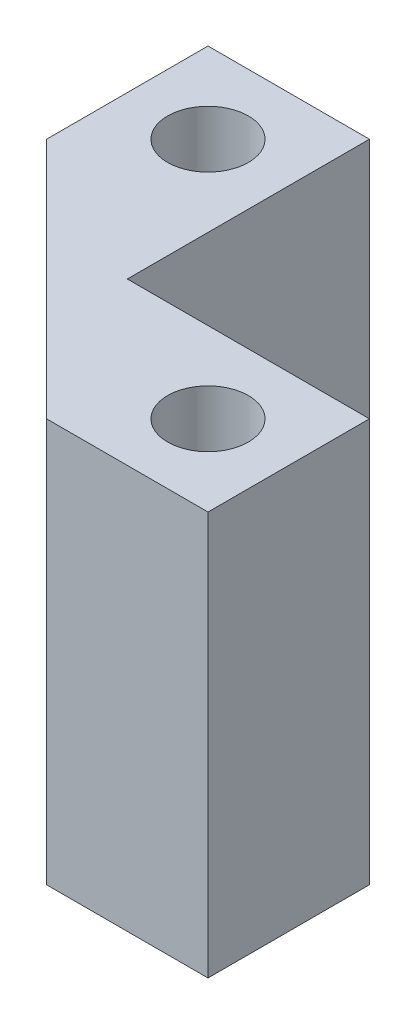
ISO-10303-21;
HEADER;
FILE_DESCRIPTION(('STEP AP214'),'2;1');
FILE_NAME('part.step','',(''),(''),'','','');
FILE_SCHEMA(('AUTOMOTIVE_DESIGN { 1 0 10303 214 1 1 1 1 }'));
ENDSEC;
DATA;
#1=APPLICATION_CONTEXT('core data for automotive mechanical design processes');
#2=APPLICATION_PROTOCOL_DEFINITION('international standard','automotive_design',2000,#1);
#3=PRODUCT_CONTEXT('',#1,'mechanical');
#4=PRODUCT('Part','Part','',(#3));
#5=PRODUCT_RELATED_PRODUCT_CATEGORY('part','',(#4));
#6=PRODUCT_DEFINITION_FORMATION('','',#4);
#7=PRODUCT_DEFINITION_CONTEXT('part definition',#1,'design');
#8=PRODUCT_DEFINITION('design','',#6,#7);
#9=PRODUCT_DEFINITION_SHAPE('','',#8);
#10=(LENGTH_UNIT() NAMED_UNIT(*) SI_UNIT(.MILLI.,.METRE.));
#11=(NAMED_UNIT(*) PLANE_ANGLE_UNIT() SI_UNIT($,.RADIAN.));
#12=(NAMED_UNIT(*) SI_UNIT($,.STERADIAN.) SOLID_ANGLE_UNIT());
#13=UNCERTAINTY_MEASURE_WITH_UNIT(LENGTH_MEASURE(1.E-05),#10,'distance_accuracy_value','');
#14=(GEOMETRIC_REPRESENTATION_CONTEXT(3) GLOBAL_UNCERTAINTY_ASSIGNED_CONTEXT((#13)) GLOBAL_UNIT_ASSIGNED_CONTEXT((#10,
#11,#12)) REPRESENTATION_CONTEXT('',''));
#15=CARTESIAN_POINT('',(0.,0.,0.));
#16=DIRECTION('',(0.,0.,1.));
#17=DIRECTION('',(1.,0.,0.));
#18=AXIS2_PLACEMENT_3D('',#15,#16,#17);
#19=CARTESIAN_POINT('',(0.,25.,0.));
#20=DIRECTION('',(0.,-1.,0.));
#21=DIRECTION('',(0.,0.,-1.));
#22=AXIS2_PLACEMENT_3D('',#19,#20,#21);
#23=PLANE('',#22);
#24=DIRECTION('',(-1.,0.,0.));
#25=VECTOR('',#24,1.);
#26=CARTESIAN_POINT('',(5.,25.,-5.));
#27=LINE('',#26,#25);
#28=CARTESIAN_POINT('',(20.,25.,-5.));
#29=VERTEX_POINT('',#28);
#30=CARTESIAN_POINT('',(5.,25.,-5.));
#31=VERTEX_POINT('',#30);
#32=EDGE_CURVE('E137',#29,#31,#27,.T.);
#33=ORIENTED_EDGE('',*,*,#32,.T.);
#34=DIRECTION('',(0.,0.,-1.));
#35=VECTOR('',#34,1.);
#36=CARTESIAN_POINT('',(5.,25.,-5.));
#37=LINE('',#36,#35);
#38=CARTESIAN_POINT('',(5.,25.,-20.));
#39=VERTEX_POINT('',#38);
#40=EDGE_CURVE('E90',#31,#39,#37,.T.);
#41=ORIENTED_EDGE('',*,*,#40,.T.);
#42=DIRECTION('',(-1.,0.,0.));
#43=VECTOR('',#42,1.);
#44=CARTESIAN_POINT('',(5.,25.,-20.));
#45=LINE('',#44,#43);
#46=CARTESIAN_POINT('',(-5.,25.,-20.));
#47=VERTEX_POINT('',#46);
#48=EDGE_CURVE('E149',#39,#47,#45,.T.);
#49=ORIENTED_EDGE('',*,*,#48,.T.);
#50=DIRECTION('',(0.,0.,1.));
#51=VECTOR('',#50,1.);
#52=CARTESIAN_POINT('',(-5.,25.,-20.));
#53=LINE('',#52,#51);
#54=CARTESIAN_POINT('',(-4.99999999999997,25.,-10.));
#55=VERTEX_POINT('',#54);
#56=EDGE_CURVE('E106',#47,#55,#53,.T.);
#57=ORIENTED_EDGE('',*,*,#56,.T.);
#58=DIRECTION('',(0.707106781186549,0.,0.707106781186546));
#59=VECTOR('',#58,1.);
#60=CARTESIAN_POINT('',(-4.99999999999997,25.,-10.));
#61=LINE('',#60,#59);
#62=CARTESIAN_POINT('',(10.0000000000001,25.,5.));
#63=VERTEX_POINT('',#62);
#64=EDGE_CURVE('E100',#55,#63,#61,.T.);
#65=ORIENTED_EDGE('',*,*,#64,.T.);
#66=DIRECTION('',(1.,0.,0.));
#67=VECTOR('',#66,1.);
#68=CARTESIAN_POINT('',(20.,25.,5.));
#69=LINE('',#68,#67);
#70=CARTESIAN_POINT('',(20.,25.,5.));
#71=VERTEX_POINT('',#70);
#72=EDGE_CURVE('E104',#63,#71,#69,.T.);
#73=ORIENTED_EDGE('',*,*,#72,.T.);
#74=DIRECTION('',(0.,0.,-1.));
#75=VECTOR('',#74,1.);
#76=CARTESIAN_POINT('',(20.,25.,-5.));
#77=LINE('',#76,#75);
#78=EDGE_CURVE('E50',#71,#29,#77,.T.);
#79=ORIENTED_EDGE('',*,*,#78,.T.);
#80=EDGE_LOOP('',(#33,#41,#49,#57,#65,#73,#79));
#81=FACE_BOUND('',#80,.T.);
#82=CARTESIAN_POINT('',(0.,25.,-15.));
#83=DIRECTION('',(0.,1.,0.));
#84=DIRECTION('',(0.,0.,1.));
#85=AXIS2_PLACEMENT_3D('',#82,#83,#84);
#86=CIRCLE('',#85,2.5);
#87=CARTESIAN_POINT('',(0.,25.,-12.5));
#88=VERTEX_POINT('',#87);
#89=EDGE_CURVE('E128',#88,#88,#86,.T.);
#90=ORIENTED_EDGE('',*,*,#89,.F.);
#91=EDGE_LOOP('',(#90));
#92=FACE_BOUND('',#91,.T.);
#93=CARTESIAN_POINT('',(15.,25.,0.));
#94=DIRECTION('',(0.,1.,0.));
#95=DIRECTION('',(0.,0.,1.));
#96=AXIS2_PLACEMENT_3D('',#93,#94,#95);
#97=CIRCLE('',#96,2.5);
#98=CARTESIAN_POINT('',(15.,25.,2.5));
#99=VERTEX_POINT('',#98);
#100=EDGE_CURVE('E164',#99,#99,#97,.T.);
#101=ORIENTED_EDGE('',*,*,#100,.F.);
#102=EDGE_LOOP('',(#101));
#103=FACE_BOUND('',#102,.T.);
#104=ADVANCED_FACE('F33',(#81,#92,#103),#23,.F.);
#105=CARTESIAN_POINT('',(0.,0.,0.));
#106=DIRECTION('',(0.,-1.,0.));
#107=DIRECTION('',(0.,0.,-1.));
#108=AXIS2_PLACEMENT_3D('',#105,#106,#107);
#109=PLANE('',#108);
#110=CARTESIAN_POINT('',(0.,0.,-15.));
#111=DIRECTION('',(0.,1.,0.));
#112=DIRECTION('',(0.,0.,1.));
#113=AXIS2_PLACEMENT_3D('',#110,#111,#112);
#114=CIRCLE('',#113,2.5);
#115=CARTESIAN_POINT('',(0.,0.,-12.5));
#116=VERTEX_POINT('',#115);
#117=EDGE_CURVE('E161',#116,#116,#114,.T.);
#118=ORIENTED_EDGE('',*,*,#117,.T.);
#119=EDGE_LOOP('',(#118));
#120=FACE_BOUND('',#119,.T.);
#121=DIRECTION('',(-1.,0.,0.));
#122=VECTOR('',#121,1.);
#123=CARTESIAN_POINT('',(5.,0.,-5.));
#124=LINE('',#123,#122);
#125=CARTESIAN_POINT('',(20.,0.,-5.));
#126=VERTEX_POINT('',#125);
#127=CARTESIAN_POINT('',(5.,0.,-5.));
#128=VERTEX_POINT('',#127);
#129=EDGE_CURVE('E124',#126,#128,#124,.T.);
#130=ORIENTED_EDGE('',*,*,#129,.F.);
#131=DIRECTION('',(0.,0.,-1.));
#132=VECTOR('',#131,1.);
#133=CARTESIAN_POINT('',(20.,0.,-5.));
#134=LINE('',#133,#132);
#135=CARTESIAN_POINT('',(20.,0.,5.));
#136=VERTEX_POINT('',#135);
#137=EDGE_CURVE('E82',#136,#126,#134,.T.);
#138=ORIENTED_EDGE('',*,*,#137,.F.);
#139=DIRECTION('',(1.,0.,0.));
#140=VECTOR('',#139,1.);
#141=CARTESIAN_POINT('',(20.,0.,5.));
#142=LINE('',#141,#140);
#143=CARTESIAN_POINT('',(10.0000000000001,0.,5.));
#144=VERTEX_POINT('',#143);
#145=EDGE_CURVE('E76',#144,#136,#142,.T.);
#146=ORIENTED_EDGE('',*,*,#145,.F.);
#147=DIRECTION('',(0.707106781186549,0.,0.707106781186546));
#148=VECTOR('',#147,1.);
#149=CARTESIAN_POINT('',(-4.99999999999997,0.,-10.));
#150=LINE('',#149,#148);
#151=CARTESIAN_POINT('',(-4.99999999999997,0.,-10.));
#152=VERTEX_POINT('',#151);
#153=EDGE_CURVE('E114',#152,#144,#150,.T.);
#154=ORIENTED_EDGE('',*,*,#153,.F.);
#155=DIRECTION('',(0.,0.,1.));
#156=VECTOR('',#155,1.);
#157=CARTESIAN_POINT('',(-5.,0.,-20.));
#158=LINE('',#157,#156);
#159=CARTESIAN_POINT('',(-5.,0.,-20.));
#160=VERTEX_POINT('',#159);
#161=EDGE_CURVE('E132',#160,#152,#158,.T.);
#162=ORIENTED_EDGE('',*,*,#161,.F.);
#163=DIRECTION('',(-1.,0.,0.));
#164=VECTOR('',#163,1.);
#165=CARTESIAN_POINT('',(5.,0.,-20.));
#166=LINE('',#165,#164);
#167=CARTESIAN_POINT('',(5.,0.,-20.));
#168=VERTEX_POINT('',#167);
#169=EDGE_CURVE('E130',#168,#160,#166,.T.);
#170=ORIENTED_EDGE('',*,*,#169,.F.);
#171=DIRECTION('',(0.,0.,-1.));
#172=VECTOR('',#171,1.);
#173=CARTESIAN_POINT('',(5.,0.,-5.));
#174=LINE('',#173,#172);
#175=EDGE_CURVE('E127',#128,#168,#174,.T.);
#176=ORIENTED_EDGE('',*,*,#175,.F.);
#177=EDGE_LOOP('',(#130,#138,#146,#154,#162,#170,#176));
#178=FACE_BOUND('',#177,.T.);
#179=CARTESIAN_POINT('',(15.,0.,0.));
#180=DIRECTION('',(0.,1.,0.));
#181=DIRECTION('',(0.,0.,1.));
#182=AXIS2_PLACEMENT_3D('',#179,#180,#181);
#183=CIRCLE('',#182,2.5);
#184=CARTESIAN_POINT('',(15.,0.,2.5));
#185=VERTEX_POINT('',#184);
#186=EDGE_CURVE('E167',#185,#185,#183,.T.);
#187=ORIENTED_EDGE('',*,*,#186,.T.);
#188=EDGE_LOOP('',(#187));
#189=FACE_BOUND('',#188,.T.);
#190=ADVANCED_FACE('F153',(#120,#178,#189),#109,.T.);
#191=CARTESIAN_POINT('',(5.,25.,-5.));
#192=DIRECTION('',(0.,0.,1.));
#193=DIRECTION('',(1.,0.,0.));
#194=AXIS2_PLACEMENT_3D('',#191,#192,#193);
#195=PLANE('',#194);
#196=ORIENTED_EDGE('',*,*,#129,.T.);
#197=DIRECTION('',(0.,-1.,0.));
#198=VECTOR('',#197,1.);
#199=CARTESIAN_POINT('',(5.,25.,-5.));
#200=LINE('',#199,#198);
#201=EDGE_CURVE('E11',#31,#128,#200,.T.);
#202=ORIENTED_EDGE('',*,*,#201,.F.);
#203=ORIENTED_EDGE('',*,*,#32,.F.);
#204=DIRECTION('',(0.,-1.,0.));
#205=VECTOR('',#204,1.);
#206=CARTESIAN_POINT('',(20.,25.,-5.));
#207=LINE('',#206,#205);
#208=EDGE_CURVE('E120',#29,#126,#207,.T.);
#209=ORIENTED_EDGE('',*,*,#208,.T.);
#210=EDGE_LOOP('',(#196,#202,#203,#209));
#211=FACE_BOUND('',#210,.T.);
#212=ADVANCED_FACE('F35',(#211),#195,.F.);
#213=CARTESIAN_POINT('',(5.,25.,-5.));
#214=DIRECTION('',(-1.,0.,0.));
#215=DIRECTION('',(0.,0.,1.));
#216=AXIS2_PLACEMENT_3D('',#213,#214,#215);
#217=PLANE('',#216);
#218=ORIENTED_EDGE('',*,*,#175,.T.);
#219=DIRECTION('',(0.,-1.,0.));
#220=VECTOR('',#219,1.);
#221=CARTESIAN_POINT('',(5.,25.,-20.));
#222=LINE('',#221,#220);
#223=EDGE_CURVE('E42',#39,#168,#222,.T.);
#224=ORIENTED_EDGE('',*,*,#223,.F.);
#225=ORIENTED_EDGE('',*,*,#40,.F.);
#226=ORIENTED_EDGE('',*,*,#201,.T.);
#227=EDGE_LOOP('',(#218,#224,#225,#226));
#228=FACE_BOUND('',#227,.T.);
#229=ADVANCED_FACE('F197',(#228),#217,.F.);
#230=CARTESIAN_POINT('',(5.,25.,-20.));
#231=DIRECTION('',(0.,0.,1.));
#232=DIRECTION('',(1.,0.,0.));
#233=AXIS2_PLACEMENT_3D('',#230,#231,#232);
#234=PLANE('',#233);
#235=ORIENTED_EDGE('',*,*,#169,.T.);
#236=DIRECTION('',(0.,-1.,0.));
#237=VECTOR('',#236,1.);
#238=CARTESIAN_POINT('',(-5.,25.,-20.));
#239=LINE('',#238,#237);
#240=EDGE_CURVE('E141',#47,#160,#239,.T.);
#241=ORIENTED_EDGE('',*,*,#240,.F.);
#242=ORIENTED_EDGE('',*,*,#48,.F.);
#243=ORIENTED_EDGE('',*,*,#223,.T.);
#244=EDGE_LOOP('',(#235,#241,#242,#243));
#245=FACE_BOUND('',#244,.T.);
#246=ADVANCED_FACE('F147',(#245),#234,.F.);
#247=CARTESIAN_POINT('',(-5.,25.,-20.));
#248=DIRECTION('',(1.,0.,0.));
#249=DIRECTION('',(0.,0.,-1.));
#250=AXIS2_PLACEMENT_3D('',#247,#248,#249);
#251=PLANE('',#250);
#252=ORIENTED_EDGE('',*,*,#161,.T.);
#253=DIRECTION('',(0.,-1.,0.));
#254=VECTOR('',#253,1.);
#255=CARTESIAN_POINT('',(-4.99999999999997,25.,-10.));
#256=LINE('',#255,#254);
#257=EDGE_CURVE('E115',#55,#152,#256,.T.);
#258=ORIENTED_EDGE('',*,*,#257,.F.);
#259=ORIENTED_EDGE('',*,*,#56,.F.);
#260=ORIENTED_EDGE('',*,*,#240,.T.);
#261=EDGE_LOOP('',(#252,#258,#259,#260));
#262=FACE_BOUND('',#261,.T.);
#263=ADVANCED_FACE('F156',(#262),#251,.F.);
#264=CARTESIAN_POINT('',(-4.99999999999997,25.,-10.));
#265=DIRECTION('',(0.707106781186546,0.,-0.707106781186549));
#266=DIRECTION('',(-0.707106781186549,0.,-0.707106781186546));
#267=AXIS2_PLACEMENT_3D('',#264,#265,#266);
#268=PLANE('',#267);
#269=ORIENTED_EDGE('',*,*,#153,.T.);
#270=DIRECTION('',(0.,-1.,0.));
#271=VECTOR('',#270,1.);
#272=CARTESIAN_POINT('',(10.0000000000001,25.,5.));
#273=LINE('',#272,#271);
#274=EDGE_CURVE('E111',#63,#144,#273,.T.);
#275=ORIENTED_EDGE('',*,*,#274,.F.);
#276=ORIENTED_EDGE('',*,*,#64,.F.);
#277=ORIENTED_EDGE('',*,*,#257,.T.);
#278=EDGE_LOOP('',(#269,#275,#276,#277));
#279=FACE_BOUND('',#278,.T.);
#280=ADVANCED_FACE('F112',(#279),#268,.F.);
#281=CARTESIAN_POINT('',(20.,25.,5.));
#282=DIRECTION('',(0.,0.,-1.));
#283=DIRECTION('',(-1.,0.,0.));
#284=AXIS2_PLACEMENT_3D('',#281,#282,#283);
#285=PLANE('',#284);
#286=ORIENTED_EDGE('',*,*,#145,.T.);
#287=DIRECTION('',(0.,-1.,0.));
#288=VECTOR('',#287,1.);
#289=CARTESIAN_POINT('',(20.,25.,5.));
#290=LINE('',#289,#288);
#291=EDGE_CURVE('E116',#71,#136,#290,.T.);
#292=ORIENTED_EDGE('',*,*,#291,.F.);
#293=ORIENTED_EDGE('',*,*,#72,.F.);
#294=ORIENTED_EDGE('',*,*,#274,.T.);
#295=EDGE_LOOP('',(#286,#292,#293,#294));
#296=FACE_BOUND('',#295,.T.);
#297=ADVANCED_FACE('F118',(#296),#285,.F.);
#298=CARTESIAN_POINT('',(20.,25.,-5.));
#299=DIRECTION('',(-1.,0.,0.));
#300=DIRECTION('',(0.,0.,1.));
#301=AXIS2_PLACEMENT_3D('',#298,#299,#300);
#302=PLANE('',#301);
#303=ORIENTED_EDGE('',*,*,#137,.T.);
#304=ORIENTED_EDGE('',*,*,#208,.F.);
#305=ORIENTED_EDGE('',*,*,#78,.F.);
#306=ORIENTED_EDGE('',*,*,#291,.T.);
#307=EDGE_LOOP('',(#303,#304,#305,#306));
#308=FACE_BOUND('',#307,.T.);
#309=ADVANCED_FACE('F187',(#308),#302,.F.);
#310=CARTESIAN_POINT('',(0.,25.,-15.));
#311=DIRECTION('',(0.,-1.,0.));
#312=DIRECTION('',(0.,0.,-1.));
#313=AXIS2_PLACEMENT_3D('',#310,#311,#312);
#314=CYLINDRICAL_SURFACE('',#313,2.5);
#315=ORIENTED_EDGE('',*,*,#89,.T.);
#316=EDGE_LOOP('',(#315));
#317=FACE_BOUND('',#316,.T.);
#318=ORIENTED_EDGE('',*,*,#117,.F.);
#319=EDGE_LOOP('',(#318));
#320=FACE_BOUND('',#319,.T.);
#321=ADVANCED_FACE('F184',(#317,#320),#314,.F.);
#322=CARTESIAN_POINT('',(15.,25.,0.));
#323=DIRECTION('',(0.,-1.,0.));
#324=DIRECTION('',(0.,0.,-1.));
#325=AXIS2_PLACEMENT_3D('',#322,#323,#324);
#326=CYLINDRICAL_SURFACE('',#325,2.5);
#327=ORIENTED_EDGE('',*,*,#100,.T.);
#328=EDGE_LOOP('',(#327));
#329=FACE_BOUND('',#328,.T.);
#330=ORIENTED_EDGE('',*,*,#186,.F.);
#331=EDGE_LOOP('',(#330));
#332=FACE_BOUND('',#331,.T.);
#333=ADVANCED_FACE('F173',(#329,#332),#326,.F.);
#334=CLOSED_SHELL('',(#104,#190,#212,#229,#246,#263,#280,#297,#309,#321,#333));
#335=MANIFOLD_SOLID_BREP('B2',#334);
#336=ADVANCED_BREP_SHAPE_REPRESENTATION('',(#18,#335),#14);
#337=SHAPE_DEFINITION_REPRESENTATION(#9,#336);
ENDSEC;
END-ISO-10303-21;
